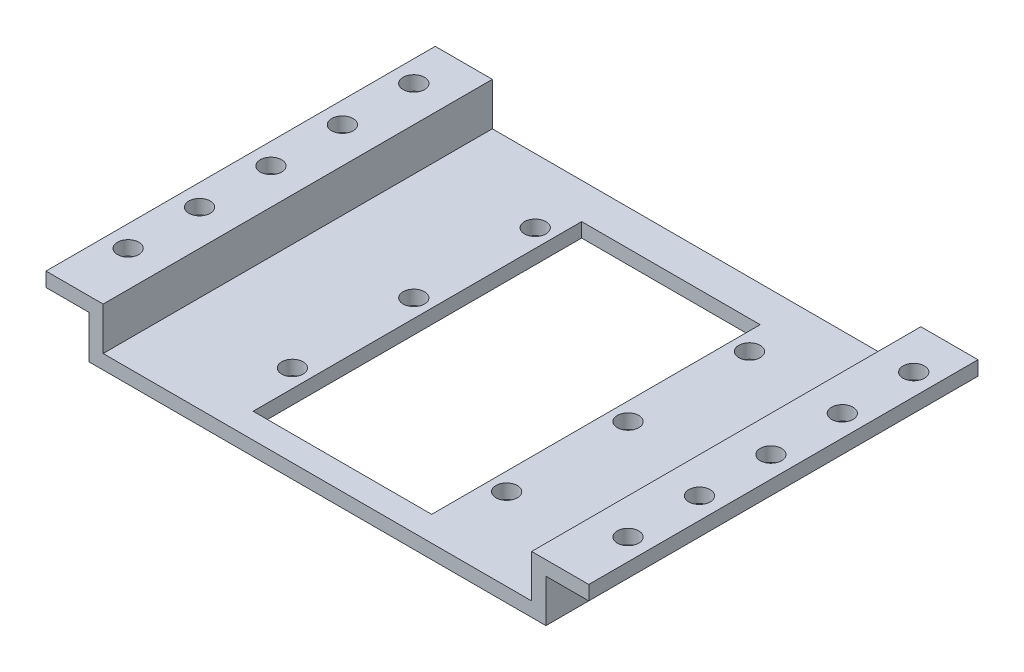
ISO-10303-21;
HEADER;
FILE_DESCRIPTION(('STEP AP214'),'2;1');
FILE_NAME('part.step','',(''),(''),'','','');
FILE_SCHEMA(('AUTOMOTIVE_DESIGN { 1 0 10303 214 1 1 1 1 }'));
ENDSEC;
DATA;
#1=APPLICATION_CONTEXT('core data for automotive mechanical design processes');
#2=APPLICATION_PROTOCOL_DEFINITION('international standard','automotive_design',2000,#1);
#3=PRODUCT_CONTEXT('',#1,'mechanical');
#4=PRODUCT('Part','Part','',(#3));
#5=PRODUCT_RELATED_PRODUCT_CATEGORY('part','',(#4));
#6=PRODUCT_DEFINITION_FORMATION('','',#4);
#7=PRODUCT_DEFINITION_CONTEXT('part definition',#1,'design');
#8=PRODUCT_DEFINITION('design','',#6,#7);
#9=PRODUCT_DEFINITION_SHAPE('','',#8);
#10=(LENGTH_UNIT() NAMED_UNIT(*) SI_UNIT(.MILLI.,.METRE.));
#11=(NAMED_UNIT(*) PLANE_ANGLE_UNIT() SI_UNIT($,.RADIAN.));
#12=(NAMED_UNIT(*) SI_UNIT($,.STERADIAN.) SOLID_ANGLE_UNIT());
#13=UNCERTAINTY_MEASURE_WITH_UNIT(LENGTH_MEASURE(1.E-05),#10,'distance_accuracy_value','');
#14=(GEOMETRIC_REPRESENTATION_CONTEXT(3) GLOBAL_UNCERTAINTY_ASSIGNED_CONTEXT((#13)) GLOBAL_UNIT_ASSIGNED_CONTEXT((#10,
#11,#12)) REPRESENTATION_CONTEXT('',''));
#15=CARTESIAN_POINT('',(0.,0.,0.));
#16=DIRECTION('',(0.,0.,1.));
#17=DIRECTION('',(1.,0.,0.));
#18=AXIS2_PLACEMENT_3D('',#15,#16,#17);
#19=CARTESIAN_POINT('',(-38.,8.,50.));
#20=DIRECTION('',(1.,0.,0.));
#21=DIRECTION('',(0.,0.,-1.));
#22=AXIS2_PLACEMENT_3D('',#19,#20,#21);
#23=PLANE('',#22);
#24=DIRECTION('',(0.,0.,-1.));
#25=VECTOR('',#24,1.);
#26=CARTESIAN_POINT('',(-38.,8.,50.));
#27=LINE('',#26,#25);
#28=CARTESIAN_POINT('',(-38.,8.,58.5));
#29=VERTEX_POINT('',#28);
#30=CARTESIAN_POINT('',(-38.,8.,4.));
#31=VERTEX_POINT('',#30);
#32=EDGE_CURVE('E355',#29,#31,#27,.T.);
#33=ORIENTED_EDGE('',*,*,#32,.T.);
#34=DIRECTION('',(0.,1.,0.));
#35=VECTOR('',#34,1.);
#36=CARTESIAN_POINT('',(-38.,-2.,4.));
#37=LINE('',#36,#35);
#38=CARTESIAN_POINT('',(-38.,6.,4.));
#39=VERTEX_POINT('',#38);
#40=EDGE_CURVE('E220',#39,#31,#37,.T.);
#41=ORIENTED_EDGE('',*,*,#40,.F.);
#42=DIRECTION('',(0.,0.,-1.));
#43=VECTOR('',#42,1.);
#44=CARTESIAN_POINT('',(-38.,6.,50.));
#45=LINE('',#44,#43);
#46=CARTESIAN_POINT('',(-38.,6.,58.5));
#47=VERTEX_POINT('',#46);
#48=EDGE_CURVE('E42',#47,#39,#45,.T.);
#49=ORIENTED_EDGE('',*,*,#48,.F.);
#50=DIRECTION('',(0.,-1.,0.));
#51=VECTOR('',#50,1.);
#52=CARTESIAN_POINT('',(-38.,8.,58.5));
#53=LINE('',#52,#51);
#54=EDGE_CURVE('E211',#29,#47,#53,.T.);
#55=ORIENTED_EDGE('',*,*,#54,.F.);
#56=EDGE_LOOP('',(#33,#41,#49,#55));
#57=FACE_BOUND('',#56,.T.);
#58=ADVANCED_FACE('F34',(#57),#23,.F.);
#59=CARTESIAN_POINT('',(-38.,6.,50.));
#60=DIRECTION('',(0.,1.,0.));
#61=DIRECTION('',(0.,0.,1.));
#62=AXIS2_PLACEMENT_3D('',#59,#60,#61);
#63=PLANE('',#62);
#64=CARTESIAN_POINT('',(-35.,6.,50.));
#65=DIRECTION('',(0.,1.,0.));
#66=DIRECTION('',(0.,0.,1.));
#67=AXIS2_PLACEMENT_3D('',#64,#65,#66);
#68=CIRCLE('',#67,1.49999999999999);
#69=CARTESIAN_POINT('',(-35.,6.,51.5));
#70=VERTEX_POINT('',#69);
#71=EDGE_CURVE('E172',#70,#70,#68,.T.);
#72=ORIENTED_EDGE('',*,*,#71,.T.);
#73=EDGE_LOOP('',(#72));
#74=FACE_BOUND('',#73,.T.);
#75=CARTESIAN_POINT('',(-35.,6.,20.));
#76=DIRECTION('',(0.,1.,0.));
#77=DIRECTION('',(0.,0.,1.));
#78=AXIS2_PLACEMENT_3D('',#75,#76,#77);
#79=CIRCLE('',#78,1.5);
#80=CARTESIAN_POINT('',(-35.,6.,21.5));
#81=VERTEX_POINT('',#80);
#82=EDGE_CURVE('E316',#81,#81,#79,.T.);
#83=ORIENTED_EDGE('',*,*,#82,.T.);
#84=EDGE_LOOP('',(#83));
#85=FACE_BOUND('',#84,.T.);
#86=CARTESIAN_POINT('',(-35.,6.,10.));
#87=DIRECTION('',(0.,1.,0.));
#88=DIRECTION('',(0.,0.,1.));
#89=AXIS2_PLACEMENT_3D('',#86,#87,#88);
#90=CIRCLE('',#89,1.5);
#91=CARTESIAN_POINT('',(-35.,6.,11.5));
#92=VERTEX_POINT('',#91);
#93=EDGE_CURVE('E322',#92,#92,#90,.T.);
#94=ORIENTED_EDGE('',*,*,#93,.T.);
#95=EDGE_LOOP('',(#94));
#96=FACE_BOUND('',#95,.T.);
#97=CARTESIAN_POINT('',(-35.,6.,30.));
#98=DIRECTION('',(0.,1.,0.));
#99=DIRECTION('',(0.,0.,1.));
#100=AXIS2_PLACEMENT_3D('',#97,#98,#99);
#101=CIRCLE('',#100,1.5);
#102=CARTESIAN_POINT('',(-35.,6.,31.5));
#103=VERTEX_POINT('',#102);
#104=EDGE_CURVE('E328',#103,#103,#101,.T.);
#105=ORIENTED_EDGE('',*,*,#104,.T.);
#106=EDGE_LOOP('',(#105));
#107=FACE_BOUND('',#106,.T.);
#108=CARTESIAN_POINT('',(-35.,6.,40.));
#109=DIRECTION('',(0.,1.,0.));
#110=DIRECTION('',(0.,0.,1.));
#111=AXIS2_PLACEMENT_3D('',#108,#109,#110);
#112=CIRCLE('',#111,1.5);
#113=CARTESIAN_POINT('',(-35.,6.,41.5));
#114=VERTEX_POINT('',#113);
#115=EDGE_CURVE('E334',#114,#114,#112,.T.);
#116=ORIENTED_EDGE('',*,*,#115,.T.);
#117=EDGE_LOOP('',(#116));
#118=FACE_BOUND('',#117,.T.);
#119=ORIENTED_EDGE('',*,*,#48,.T.);
#120=DIRECTION('',(1.,0.,0.));
#121=VECTOR('',#120,1.);
#122=CARTESIAN_POINT('',(-38.,6.,4.));
#123=LINE('',#122,#121);
#124=CARTESIAN_POINT('',(-32.,6.,4.));
#125=VERTEX_POINT('',#124);
#126=EDGE_CURVE('E241',#39,#125,#123,.T.);
#127=ORIENTED_EDGE('',*,*,#126,.T.);
#128=DIRECTION('',(0.,0.,-1.));
#129=VECTOR('',#128,1.);
#130=CARTESIAN_POINT('',(-32.,6.,50.));
#131=LINE('',#130,#129);
#132=CARTESIAN_POINT('',(-32.,6.,58.5));
#133=VERTEX_POINT('',#132);
#134=EDGE_CURVE('E367',#133,#125,#131,.T.);
#135=ORIENTED_EDGE('',*,*,#134,.F.);
#136=DIRECTION('',(1.,0.,0.));
#137=VECTOR('',#136,1.);
#138=CARTESIAN_POINT('',(-38.,6.,58.5));
#139=LINE('',#138,#137);
#140=EDGE_CURVE('E214',#47,#133,#139,.T.);
#141=ORIENTED_EDGE('',*,*,#140,.F.);
#142=EDGE_LOOP('',(#119,#127,#135,#141));
#143=FACE_BOUND('',#142,.T.);
#144=ADVANCED_FACE('F395',(#74,#85,#96,#107,#118,#143),#63,.F.);
#145=CARTESIAN_POINT('',(-32.,6.,50.));
#146=DIRECTION('',(1.,0.,0.));
#147=DIRECTION('',(0.,0.,-1.));
#148=AXIS2_PLACEMENT_3D('',#145,#146,#147);
#149=PLANE('',#148);
#150=ORIENTED_EDGE('',*,*,#134,.T.);
#151=DIRECTION('',(0.,-1.,0.));
#152=VECTOR('',#151,1.);
#153=CARTESIAN_POINT('',(-32.,6.,4.));
#154=LINE('',#153,#152);
#155=CARTESIAN_POINT('',(-32.,0.,4.));
#156=VERTEX_POINT('',#155);
#157=EDGE_CURVE('E238',#125,#156,#154,.T.);
#158=ORIENTED_EDGE('',*,*,#157,.T.);
#159=DIRECTION('',(0.,0.,-1.));
#160=VECTOR('',#159,1.);
#161=CARTESIAN_POINT('',(-32.,0.,50.));
#162=LINE('',#161,#160);
#163=CARTESIAN_POINT('',(-32.,0.,58.5));
#164=VERTEX_POINT('',#163);
#165=EDGE_CURVE('E364',#164,#156,#162,.T.);
#166=ORIENTED_EDGE('',*,*,#165,.F.);
#167=DIRECTION('',(0.,-1.,0.));
#168=VECTOR('',#167,1.);
#169=CARTESIAN_POINT('',(-32.,6.,58.5));
#170=LINE('',#169,#168);
#171=EDGE_CURVE('E181',#133,#164,#170,.T.);
#172=ORIENTED_EDGE('',*,*,#171,.F.);
#173=EDGE_LOOP('',(#150,#158,#166,#172));
#174=FACE_BOUND('',#173,.T.);
#175=ADVANCED_FACE('F400',(#174),#149,.F.);
#176=CARTESIAN_POINT('',(-32.,0.,50.));
#177=DIRECTION('',(0.,1.,0.));
#178=DIRECTION('',(0.,0.,1.));
#179=AXIS2_PLACEMENT_3D('',#176,#177,#178);
#180=PLANE('',#179);
#181=DIRECTION('',(1.,0.,0.));
#182=VECTOR('',#181,1.);
#183=CARTESIAN_POINT('',(-32.,0.,55.));
#184=LINE('',#183,#182);
#185=CARTESIAN_POINT('',(-12.5,0.,55.));
#186=VERTEX_POINT('',#185);
#187=CARTESIAN_POINT('',(12.5,0.,55.));
#188=VERTEX_POINT('',#187);
#189=EDGE_CURVE('E165',#186,#188,#184,.T.);
#190=ORIENTED_EDGE('',*,*,#189,.T.);
#191=DIRECTION('',(0.,0.,-1.));
#192=VECTOR('',#191,1.);
#193=CARTESIAN_POINT('',(12.5,0.,50.));
#194=LINE('',#193,#192);
#195=CARTESIAN_POINT('',(12.5,0.,8.99999999999999));
#196=VERTEX_POINT('',#195);
#197=EDGE_CURVE('E284',#188,#196,#194,.T.);
#198=ORIENTED_EDGE('',*,*,#197,.T.);
#199=DIRECTION('',(1.,0.,0.));
#200=VECTOR('',#199,1.);
#201=CARTESIAN_POINT('',(12.5,0.,8.99999999999999));
#202=LINE('',#201,#200);
#203=CARTESIAN_POINT('',(-12.5,0.,8.99999999999999));
#204=VERTEX_POINT('',#203);
#205=EDGE_CURVE('E306',#204,#196,#202,.T.);
#206=ORIENTED_EDGE('',*,*,#205,.F.);
#207=DIRECTION('',(0.,0.,-1.));
#208=VECTOR('',#207,1.);
#209=CARTESIAN_POINT('',(-12.5,0.,50.));
#210=LINE('',#209,#208);
#211=EDGE_CURVE('E155',#186,#204,#210,.T.);
#212=ORIENTED_EDGE('',*,*,#211,.F.);
#213=EDGE_LOOP('',(#190,#198,#206,#212));
#214=FACE_BOUND('',#213,.T.);
#215=CARTESIAN_POINT('',(-15.,0.,47.));
#216=DIRECTION('',(0.,1.,0.));
#217=DIRECTION('',(0.,0.,1.));
#218=AXIS2_PLACEMENT_3D('',#215,#216,#217);
#219=CIRCLE('',#218,1.5);
#220=CARTESIAN_POINT('',(-15.,0.,48.5));
#221=VERTEX_POINT('',#220);
#222=EDGE_CURVE('E340',#221,#221,#219,.T.);
#223=ORIENTED_EDGE('',*,*,#222,.T.);
#224=EDGE_LOOP('',(#223));
#225=FACE_BOUND('',#224,.T.);
#226=CARTESIAN_POINT('',(-15.,0.,30.));
#227=DIRECTION('',(0.,1.,0.));
#228=DIRECTION('',(0.,0.,1.));
#229=AXIS2_PLACEMENT_3D('',#226,#227,#228);
#230=CIRCLE('',#229,1.5);
#231=CARTESIAN_POINT('',(-15.,0.,31.5));
#232=VERTEX_POINT('',#231);
#233=EDGE_CURVE('E346',#232,#232,#230,.T.);
#234=ORIENTED_EDGE('',*,*,#233,.T.);
#235=EDGE_LOOP('',(#234));
#236=FACE_BOUND('',#235,.T.);
#237=CARTESIAN_POINT('',(-15.,0.,13.));
#238=DIRECTION('',(0.,1.,0.));
#239=DIRECTION('',(0.,0.,1.));
#240=AXIS2_PLACEMENT_3D('',#237,#238,#239);
#241=CIRCLE('',#240,1.5);
#242=CARTESIAN_POINT('',(-15.,0.,14.5));
#243=VERTEX_POINT('',#242);
#244=EDGE_CURVE('E352',#243,#243,#241,.T.);
#245=ORIENTED_EDGE('',*,*,#244,.T.);
#246=EDGE_LOOP('',(#245));
#247=FACE_BOUND('',#246,.T.);
#248=ORIENTED_EDGE('',*,*,#165,.T.);
#249=DIRECTION('',(1.,0.,0.));
#250=VECTOR('',#249,1.);
#251=CARTESIAN_POINT('',(-32.,0.,4.));
#252=LINE('',#251,#250);
#253=CARTESIAN_POINT('',(32.,0.,4.));
#254=VERTEX_POINT('',#253);
#255=EDGE_CURVE('E235',#156,#254,#252,.T.);
#256=ORIENTED_EDGE('',*,*,#255,.T.);
#257=DIRECTION('',(0.,0.,-1.));
#258=VECTOR('',#257,1.);
#259=CARTESIAN_POINT('',(32.,0.,50.));
#260=LINE('',#259,#258);
#261=CARTESIAN_POINT('',(32.,0.,58.5));
#262=VERTEX_POINT('',#261);
#263=EDGE_CURVE('E303',#262,#254,#260,.T.);
#264=ORIENTED_EDGE('',*,*,#263,.F.);
#265=DIRECTION('',(1.,0.,0.));
#266=VECTOR('',#265,1.);
#267=CARTESIAN_POINT('',(-32.,0.,58.5));
#268=LINE('',#267,#266);
#269=EDGE_CURVE('E184',#164,#262,#268,.T.);
#270=ORIENTED_EDGE('',*,*,#269,.F.);
#271=EDGE_LOOP('',(#248,#256,#264,#270));
#272=FACE_BOUND('',#271,.T.);
#273=CARTESIAN_POINT('',(15.,0.,13.));
#274=DIRECTION('',(0.,1.,0.));
#275=DIRECTION('',(0.,0.,1.));
#276=AXIS2_PLACEMENT_3D('',#273,#274,#275);
#277=CIRCLE('',#276,1.5);
#278=CARTESIAN_POINT('',(15.,0.,14.5));
#279=VERTEX_POINT('',#278);
#280=EDGE_CURVE('E269',#279,#279,#277,.T.);
#281=ORIENTED_EDGE('',*,*,#280,.T.);
#282=EDGE_LOOP('',(#281));
#283=FACE_BOUND('',#282,.T.);
#284=CARTESIAN_POINT('',(15.,0.,30.));
#285=DIRECTION('',(0.,1.,0.));
#286=DIRECTION('',(0.,0.,1.));
#287=AXIS2_PLACEMENT_3D('',#284,#285,#286);
#288=CIRCLE('',#287,1.5);
#289=CARTESIAN_POINT('',(15.,0.,31.5));
#290=VERTEX_POINT('',#289);
#291=EDGE_CURVE('E275',#290,#290,#288,.T.);
#292=ORIENTED_EDGE('',*,*,#291,.T.);
#293=EDGE_LOOP('',(#292));
#294=FACE_BOUND('',#293,.T.);
#295=CARTESIAN_POINT('',(15.,0.,47.));
#296=DIRECTION('',(0.,1.,0.));
#297=DIRECTION('',(0.,0.,1.));
#298=AXIS2_PLACEMENT_3D('',#295,#296,#297);
#299=CIRCLE('',#298,1.5);
#300=CARTESIAN_POINT('',(15.,0.,48.5));
#301=VERTEX_POINT('',#300);
#302=EDGE_CURVE('E281',#301,#301,#299,.T.);
#303=ORIENTED_EDGE('',*,*,#302,.T.);
#304=EDGE_LOOP('',(#303));
#305=FACE_BOUND('',#304,.T.);
#306=ADVANCED_FACE('F434',(#214,#225,#236,#247,#272,#283,#294,#305),#180,.F.);
#307=CARTESIAN_POINT('',(-12.5,0.,50.));
#308=DIRECTION('',(-1.,0.,0.));
#309=DIRECTION('',(0.,0.,1.));
#310=AXIS2_PLACEMENT_3D('',#307,#308,#309);
#311=PLANE('',#310);
#312=ORIENTED_EDGE('',*,*,#211,.T.);
#313=DIRECTION('',(0.,1.,0.));
#314=VECTOR('',#313,1.);
#315=CARTESIAN_POINT('',(-12.5,0.,8.99999999999999));
#316=LINE('',#315,#314);
#317=CARTESIAN_POINT('',(-12.5,2.,8.99999999999999));
#318=VERTEX_POINT('',#317);
#319=EDGE_CURVE('E152',#204,#318,#316,.T.);
#320=ORIENTED_EDGE('',*,*,#319,.T.);
#321=DIRECTION('',(0.,0.,-1.));
#322=VECTOR('',#321,1.);
#323=CARTESIAN_POINT('',(-12.5,2.,50.));
#324=LINE('',#323,#322);
#325=CARTESIAN_POINT('',(-12.5,2.,55.));
#326=VERTEX_POINT('',#325);
#327=EDGE_CURVE('E147',#326,#318,#324,.T.);
#328=ORIENTED_EDGE('',*,*,#327,.F.);
#329=DIRECTION('',(0.,1.,0.));
#330=VECTOR('',#329,1.);
#331=CARTESIAN_POINT('',(-12.5,-6.5,55.));
#332=LINE('',#331,#330);
#333=EDGE_CURVE('E151',#186,#326,#332,.T.);
#334=ORIENTED_EDGE('',*,*,#333,.F.);
#335=EDGE_LOOP('',(#312,#320,#328,#334));
#336=FACE_BOUND('',#335,.T.);
#337=ADVANCED_FACE('F150',(#336),#311,.F.);
#338=CARTESIAN_POINT('',(-12.5,2.,50.));
#339=DIRECTION('',(0.,-1.,0.));
#340=DIRECTION('',(1.,0.,0.));
#341=AXIS2_PLACEMENT_3D('',#338,#339,#340);
#342=PLANE('',#341);
#343=DIRECTION('',(0.,0.,-1.));
#344=VECTOR('',#343,1.);
#345=CARTESIAN_POINT('',(-30.,2.,50.));
#346=LINE('',#345,#344);
#347=CARTESIAN_POINT('',(-30.,2.,58.5));
#348=VERTEX_POINT('',#347);
#349=CARTESIAN_POINT('',(-30.,2.,4.00000000000001));
#350=VERTEX_POINT('',#349);
#351=EDGE_CURVE('E156',#348,#350,#346,.T.);
#352=ORIENTED_EDGE('',*,*,#351,.F.);
#353=DIRECTION('',(-1.,0.,0.));
#354=VECTOR('',#353,1.);
#355=CARTESIAN_POINT('',(-30.,2.,58.5));
#356=LINE('',#355,#354);
#357=CARTESIAN_POINT('',(30.,2.,58.5));
#358=VERTEX_POINT('',#357);
#359=EDGE_CURVE('E202',#358,#348,#356,.T.);
#360=ORIENTED_EDGE('',*,*,#359,.F.);
#361=DIRECTION('',(0.,0.,-1.));
#362=VECTOR('',#361,1.);
#363=CARTESIAN_POINT('',(30.,2.,50.));
#364=LINE('',#363,#362);
#365=CARTESIAN_POINT('',(30.,2.,4.));
#366=VERTEX_POINT('',#365);
#367=EDGE_CURVE('E288',#358,#366,#364,.T.);
#368=ORIENTED_EDGE('',*,*,#367,.T.);
#369=DIRECTION('',(-1.,0.,0.));
#370=VECTOR('',#369,1.);
#371=CARTESIAN_POINT('',(-12.5,2.,4.));
#372=LINE('',#371,#370);
#373=EDGE_CURVE('E49',#366,#350,#372,.T.);
#374=ORIENTED_EDGE('',*,*,#373,.T.);
#375=EDGE_LOOP('',(#352,#360,#368,#374));
#376=FACE_BOUND('',#375,.T.);
#377=CARTESIAN_POINT('',(-15.,2.,47.));
#378=DIRECTION('',(0.,1.,0.));
#379=DIRECTION('',(0.,0.,1.));
#380=AXIS2_PLACEMENT_3D('',#377,#378,#379);
#381=CIRCLE('',#380,1.5);
#382=CARTESIAN_POINT('',(-15.,2.,48.5));
#383=VERTEX_POINT('',#382);
#384=EDGE_CURVE('E337',#383,#383,#381,.T.);
#385=ORIENTED_EDGE('',*,*,#384,.F.);
#386=EDGE_LOOP('',(#385));
#387=FACE_BOUND('',#386,.T.);
#388=CARTESIAN_POINT('',(-15.,2.,30.));
#389=DIRECTION('',(0.,1.,0.));
#390=DIRECTION('',(0.,0.,1.));
#391=AXIS2_PLACEMENT_3D('',#388,#389,#390);
#392=CIRCLE('',#391,1.5);
#393=CARTESIAN_POINT('',(-15.,2.,31.5));
#394=VERTEX_POINT('',#393);
#395=EDGE_CURVE('E343',#394,#394,#392,.T.);
#396=ORIENTED_EDGE('',*,*,#395,.F.);
#397=EDGE_LOOP('',(#396));
#398=FACE_BOUND('',#397,.T.);
#399=CARTESIAN_POINT('',(-15.,2.,13.));
#400=DIRECTION('',(0.,1.,0.));
#401=DIRECTION('',(0.,0.,1.));
#402=AXIS2_PLACEMENT_3D('',#399,#400,#401);
#403=CIRCLE('',#402,1.5);
#404=CARTESIAN_POINT('',(-15.,2.,14.5));
#405=VERTEX_POINT('',#404);
#406=EDGE_CURVE('E349',#405,#405,#403,.T.);
#407=ORIENTED_EDGE('',*,*,#406,.F.);
#408=EDGE_LOOP('',(#407));
#409=FACE_BOUND('',#408,.T.);
#410=DIRECTION('',(0.,0.,-1.));
#411=VECTOR('',#410,1.);
#412=CARTESIAN_POINT('',(12.5,2.,50.));
#413=LINE('',#412,#411);
#414=CARTESIAN_POINT('',(12.5,2.,55.));
#415=VERTEX_POINT('',#414);
#416=CARTESIAN_POINT('',(12.5,2.,8.99999999999999));
#417=VERTEX_POINT('',#416);
#418=EDGE_CURVE('E170',#415,#417,#413,.T.);
#419=ORIENTED_EDGE('',*,*,#418,.F.);
#420=DIRECTION('',(1.,0.,0.));
#421=VECTOR('',#420,1.);
#422=CARTESIAN_POINT('',(12.5,2.,55.));
#423=LINE('',#422,#421);
#424=EDGE_CURVE('E163',#326,#415,#423,.T.);
#425=ORIENTED_EDGE('',*,*,#424,.F.);
#426=ORIENTED_EDGE('',*,*,#327,.T.);
#427=DIRECTION('',(1.,0.,0.));
#428=VECTOR('',#427,1.);
#429=CARTESIAN_POINT('',(12.5,2.,8.99999999999999));
#430=LINE('',#429,#428);
#431=EDGE_CURVE('E56',#318,#417,#430,.T.);
#432=ORIENTED_EDGE('',*,*,#431,.T.);
#433=EDGE_LOOP('',(#419,#425,#426,#432));
#434=FACE_BOUND('',#433,.T.);
#435=CARTESIAN_POINT('',(15.,2.,13.));
#436=DIRECTION('',(0.,1.,0.));
#437=DIRECTION('',(0.,0.,1.));
#438=AXIS2_PLACEMENT_3D('',#435,#436,#437);
#439=CIRCLE('',#438,1.5);
#440=CARTESIAN_POINT('',(15.,2.,14.5));
#441=VERTEX_POINT('',#440);
#442=EDGE_CURVE('E266',#441,#441,#439,.T.);
#443=ORIENTED_EDGE('',*,*,#442,.F.);
#444=EDGE_LOOP('',(#443));
#445=FACE_BOUND('',#444,.T.);
#446=CARTESIAN_POINT('',(15.,2.,30.));
#447=DIRECTION('',(0.,1.,0.));
#448=DIRECTION('',(0.,0.,1.));
#449=AXIS2_PLACEMENT_3D('',#446,#447,#448);
#450=CIRCLE('',#449,1.5);
#451=CARTESIAN_POINT('',(15.,2.,31.5));
#452=VERTEX_POINT('',#451);
#453=EDGE_CURVE('E272',#452,#452,#450,.T.);
#454=ORIENTED_EDGE('',*,*,#453,.F.);
#455=EDGE_LOOP('',(#454));
#456=FACE_BOUND('',#455,.T.);
#457=CARTESIAN_POINT('',(15.,2.,47.));
#458=DIRECTION('',(0.,1.,0.));
#459=DIRECTION('',(0.,0.,1.));
#460=AXIS2_PLACEMENT_3D('',#457,#458,#459);
#461=CIRCLE('',#460,1.5);
#462=CARTESIAN_POINT('',(15.,2.,48.5));
#463=VERTEX_POINT('',#462);
#464=EDGE_CURVE('E278',#463,#463,#461,.T.);
#465=ORIENTED_EDGE('',*,*,#464,.F.);
#466=EDGE_LOOP('',(#465));
#467=FACE_BOUND('',#466,.T.);
#468=ADVANCED_FACE('F168',(#376,#387,#398,#409,#434,#445,#456,#467),#342,.F.);
#469=CARTESIAN_POINT('',(-30.,2.,50.));
#470=DIRECTION('',(-1.,0.,0.));
#471=DIRECTION('',(0.,0.,1.));
#472=AXIS2_PLACEMENT_3D('',#469,#470,#471);
#473=PLANE('',#472);
#474=ORIENTED_EDGE('',*,*,#351,.T.);
#475=DIRECTION('',(0.,1.,0.));
#476=VECTOR('',#475,1.);
#477=CARTESIAN_POINT('',(-30.,2.,4.));
#478=LINE('',#477,#476);
#479=CARTESIAN_POINT('',(-30.,8.,4.));
#480=VERTEX_POINT('',#479);
#481=EDGE_CURVE('E226',#350,#480,#478,.T.);
#482=ORIENTED_EDGE('',*,*,#481,.T.);
#483=DIRECTION('',(0.,0.,-1.));
#484=VECTOR('',#483,1.);
#485=CARTESIAN_POINT('',(-30.,8.,50.));
#486=LINE('',#485,#484);
#487=CARTESIAN_POINT('',(-30.,8.,58.5));
#488=VERTEX_POINT('',#487);
#489=EDGE_CURVE('E358',#488,#480,#486,.T.);
#490=ORIENTED_EDGE('',*,*,#489,.F.);
#491=DIRECTION('',(0.,1.,0.));
#492=VECTOR('',#491,1.);
#493=CARTESIAN_POINT('',(-30.,2.,58.5));
#494=LINE('',#493,#492);
#495=EDGE_CURVE('E205',#348,#488,#494,.T.);
#496=ORIENTED_EDGE('',*,*,#495,.F.);
#497=EDGE_LOOP('',(#474,#482,#490,#496));
#498=FACE_BOUND('',#497,.T.);
#499=ADVANCED_FACE('F414',(#498),#473,.F.);
#500=CARTESIAN_POINT('',(-30.,8.,50.));
#501=DIRECTION('',(0.,-1.,0.));
#502=DIRECTION('',(0.,0.,-1.));
#503=AXIS2_PLACEMENT_3D('',#500,#501,#502);
#504=PLANE('',#503);
#505=CARTESIAN_POINT('',(-35.,8.,50.));
#506=DIRECTION('',(0.,1.,0.));
#507=DIRECTION('',(0.,0.,1.));
#508=AXIS2_PLACEMENT_3D('',#505,#506,#507);
#509=CIRCLE('',#508,1.49999999999999);
#510=CARTESIAN_POINT('',(-35.,8.,51.5));
#511=VERTEX_POINT('',#510);
#512=EDGE_CURVE('E175',#511,#511,#509,.T.);
#513=ORIENTED_EDGE('',*,*,#512,.F.);
#514=EDGE_LOOP('',(#513));
#515=FACE_BOUND('',#514,.T.);
#516=CARTESIAN_POINT('',(-35.,7.99999999999999,20.));
#517=DIRECTION('',(0.,1.,0.));
#518=DIRECTION('',(0.,0.,1.));
#519=AXIS2_PLACEMENT_3D('',#516,#517,#518);
#520=CIRCLE('',#519,1.5);
#521=CARTESIAN_POINT('',(-35.,7.99999999999999,21.5));
#522=VERTEX_POINT('',#521);
#523=EDGE_CURVE('E312',#522,#522,#520,.T.);
#524=ORIENTED_EDGE('',*,*,#523,.F.);
#525=EDGE_LOOP('',(#524));
#526=FACE_BOUND('',#525,.T.);
#527=CARTESIAN_POINT('',(-35.,7.99999999999999,10.));
#528=DIRECTION('',(0.,1.,0.));
#529=DIRECTION('',(0.,0.,1.));
#530=AXIS2_PLACEMENT_3D('',#527,#528,#529);
#531=CIRCLE('',#530,1.5);
#532=CARTESIAN_POINT('',(-35.,7.99999999999999,11.5));
#533=VERTEX_POINT('',#532);
#534=EDGE_CURVE('E319',#533,#533,#531,.T.);
#535=ORIENTED_EDGE('',*,*,#534,.F.);
#536=EDGE_LOOP('',(#535));
#537=FACE_BOUND('',#536,.T.);
#538=CARTESIAN_POINT('',(-35.,7.99999999999999,30.));
#539=DIRECTION('',(0.,1.,0.));
#540=DIRECTION('',(0.,0.,1.));
#541=AXIS2_PLACEMENT_3D('',#538,#539,#540);
#542=CIRCLE('',#541,1.5);
#543=CARTESIAN_POINT('',(-35.,7.99999999999999,31.5));
#544=VERTEX_POINT('',#543);
#545=EDGE_CURVE('E325',#544,#544,#542,.T.);
#546=ORIENTED_EDGE('',*,*,#545,.F.);
#547=EDGE_LOOP('',(#546));
#548=FACE_BOUND('',#547,.T.);
#549=CARTESIAN_POINT('',(-35.,7.99999999999999,40.));
#550=DIRECTION('',(0.,1.,0.));
#551=DIRECTION('',(0.,0.,1.));
#552=AXIS2_PLACEMENT_3D('',#549,#550,#551);
#553=CIRCLE('',#552,1.5);
#554=CARTESIAN_POINT('',(-35.,7.99999999999999,41.5));
#555=VERTEX_POINT('',#554);
#556=EDGE_CURVE('E331',#555,#555,#553,.T.);
#557=ORIENTED_EDGE('',*,*,#556,.F.);
#558=EDGE_LOOP('',(#557));
#559=FACE_BOUND('',#558,.T.);
#560=ORIENTED_EDGE('',*,*,#489,.T.);
#561=DIRECTION('',(1.,0.,0.));
#562=VECTOR('',#561,1.);
#563=CARTESIAN_POINT('',(38.,8.,3.99999999999999));
#564=LINE('',#563,#562);
#565=EDGE_CURVE('E218',#31,#480,#564,.T.);
#566=ORIENTED_EDGE('',*,*,#565,.F.);
#567=ORIENTED_EDGE('',*,*,#32,.F.);
#568=DIRECTION('',(-1.,0.,0.));
#569=VECTOR('',#568,1.);
#570=CARTESIAN_POINT('',(-30.,8.,58.5));
#571=LINE('',#570,#569);
#572=EDGE_CURVE('E208',#488,#29,#571,.T.);
#573=ORIENTED_EDGE('',*,*,#572,.F.);
#574=EDGE_LOOP('',(#560,#566,#567,#573));
#575=FACE_BOUND('',#574,.T.);
#576=ADVANCED_FACE('F407',(#515,#526,#537,#548,#559,#575),#504,.F.);
#577=CARTESIAN_POINT('',(-15.,2.,13.));
#578=DIRECTION('',(0.,1.,0.));
#579=DIRECTION('',(0.,0.,1.));
#580=AXIS2_PLACEMENT_3D('',#577,#578,#579);
#581=CYLINDRICAL_SURFACE('',#580,1.5);
#582=ORIENTED_EDGE('',*,*,#244,.F.);
#583=EDGE_LOOP('',(#582));
#584=FACE_BOUND('',#583,.T.);
#585=ORIENTED_EDGE('',*,*,#406,.T.);
#586=EDGE_LOOP('',(#585));
#587=FACE_BOUND('',#586,.T.);
#588=ADVANCED_FACE('F455',(#584,#587),#581,.F.);
#589=CARTESIAN_POINT('',(-15.,2.,30.));
#590=DIRECTION('',(0.,1.,0.));
#591=DIRECTION('',(0.,0.,1.));
#592=AXIS2_PLACEMENT_3D('',#589,#590,#591);
#593=CYLINDRICAL_SURFACE('',#592,1.5);
#594=ORIENTED_EDGE('',*,*,#233,.F.);
#595=EDGE_LOOP('',(#594));
#596=FACE_BOUND('',#595,.T.);
#597=ORIENTED_EDGE('',*,*,#395,.T.);
#598=EDGE_LOOP('',(#597));
#599=FACE_BOUND('',#598,.T.);
#600=ADVANCED_FACE('F459',(#596,#599),#593,.F.);
#601=CARTESIAN_POINT('',(-15.,2.,47.));
#602=DIRECTION('',(0.,1.,0.));
#603=DIRECTION('',(0.,0.,1.));
#604=AXIS2_PLACEMENT_3D('',#601,#602,#603);
#605=CYLINDRICAL_SURFACE('',#604,1.5);
#606=ORIENTED_EDGE('',*,*,#222,.F.);
#607=EDGE_LOOP('',(#606));
#608=FACE_BOUND('',#607,.T.);
#609=ORIENTED_EDGE('',*,*,#384,.T.);
#610=EDGE_LOOP('',(#609));
#611=FACE_BOUND('',#610,.T.);
#612=ADVANCED_FACE('F463',(#608,#611),#605,.F.);
#613=CARTESIAN_POINT('',(-35.,7.99999999999999,40.));
#614=DIRECTION('',(0.,1.,0.));
#615=DIRECTION('',(0.,0.,1.));
#616=AXIS2_PLACEMENT_3D('',#613,#614,#615);
#617=CYLINDRICAL_SURFACE('',#616,1.5);
#618=ORIENTED_EDGE('',*,*,#556,.T.);
#619=EDGE_LOOP('',(#618));
#620=FACE_BOUND('',#619,.T.);
#621=ORIENTED_EDGE('',*,*,#115,.F.);
#622=EDGE_LOOP('',(#621));
#623=FACE_BOUND('',#622,.T.);
#624=ADVANCED_FACE('F467',(#620,#623),#617,.F.);
#625=CARTESIAN_POINT('',(-35.,7.99999999999999,30.));
#626=DIRECTION('',(0.,1.,0.));
#627=DIRECTION('',(0.,0.,1.));
#628=AXIS2_PLACEMENT_3D('',#625,#626,#627);
#629=CYLINDRICAL_SURFACE('',#628,1.5);
#630=ORIENTED_EDGE('',*,*,#545,.T.);
#631=EDGE_LOOP('',(#630));
#632=FACE_BOUND('',#631,.T.);
#633=ORIENTED_EDGE('',*,*,#104,.F.);
#634=EDGE_LOOP('',(#633));
#635=FACE_BOUND('',#634,.T.);
#636=ADVANCED_FACE('F471',(#632,#635),#629,.F.);
#637=CARTESIAN_POINT('',(-35.,7.99999999999999,10.));
#638=DIRECTION('',(0.,1.,0.));
#639=DIRECTION('',(0.,0.,1.));
#640=AXIS2_PLACEMENT_3D('',#637,#638,#639);
#641=CYLINDRICAL_SURFACE('',#640,1.5);
#642=ORIENTED_EDGE('',*,*,#534,.T.);
#643=EDGE_LOOP('',(#642));
#644=FACE_BOUND('',#643,.T.);
#645=ORIENTED_EDGE('',*,*,#93,.F.);
#646=EDGE_LOOP('',(#645));
#647=FACE_BOUND('',#646,.T.);
#648=ADVANCED_FACE('F475',(#644,#647),#641,.F.);
#649=CARTESIAN_POINT('',(-35.,7.99999999999999,20.));
#650=DIRECTION('',(0.,1.,0.));
#651=DIRECTION('',(0.,0.,1.));
#652=AXIS2_PLACEMENT_3D('',#649,#650,#651);
#653=CYLINDRICAL_SURFACE('',#652,1.5);
#654=ORIENTED_EDGE('',*,*,#523,.T.);
#655=EDGE_LOOP('',(#654));
#656=FACE_BOUND('',#655,.T.);
#657=ORIENTED_EDGE('',*,*,#82,.F.);
#658=EDGE_LOOP('',(#657));
#659=FACE_BOUND('',#658,.T.);
#660=ADVANCED_FACE('F479',(#656,#659),#653,.F.);
#661=CARTESIAN_POINT('',(12.5,0.,8.99999999999999));
#662=DIRECTION('',(0.,0.,1.));
#663=DIRECTION('',(1.,0.,0.));
#664=AXIS2_PLACEMENT_3D('',#661,#662,#663);
#665=PLANE('',#664);
#666=ORIENTED_EDGE('',*,*,#431,.F.);
#667=ORIENTED_EDGE('',*,*,#319,.F.);
#668=ORIENTED_EDGE('',*,*,#205,.T.);
#669=DIRECTION('',(0.,1.,0.));
#670=VECTOR('',#669,1.);
#671=CARTESIAN_POINT('',(12.5,0.,8.99999999999999));
#672=LINE('',#671,#670);
#673=EDGE_CURVE('E310',#196,#417,#672,.T.);
#674=ORIENTED_EDGE('',*,*,#673,.T.);
#675=EDGE_LOOP('',(#666,#667,#668,#674));
#676=FACE_BOUND('',#675,.T.);
#677=ADVANCED_FACE('F483',(#676),#665,.T.);
#678=CARTESIAN_POINT('',(32.,6.,50.));
#679=DIRECTION('',(-1.,0.,0.));
#680=DIRECTION('',(0.,0.,1.));
#681=AXIS2_PLACEMENT_3D('',#678,#679,#680);
#682=PLANE('',#681);
#683=ORIENTED_EDGE('',*,*,#263,.T.);
#684=DIRECTION('',(0.,1.,0.));
#685=VECTOR('',#684,1.);
#686=CARTESIAN_POINT('',(32.,6.,4.));
#687=LINE('',#686,#685);
#688=CARTESIAN_POINT('',(32.,6.,4.));
#689=VERTEX_POINT('',#688);
#690=EDGE_CURVE('E232',#254,#689,#687,.T.);
#691=ORIENTED_EDGE('',*,*,#690,.T.);
#692=DIRECTION('',(0.,0.,-1.));
#693=VECTOR('',#692,1.);
#694=CARTESIAN_POINT('',(32.,6.,50.));
#695=LINE('',#694,#693);
#696=CARTESIAN_POINT('',(32.,6.,58.5));
#697=VERTEX_POINT('',#696);
#698=EDGE_CURVE('E300',#697,#689,#695,.T.);
#699=ORIENTED_EDGE('',*,*,#698,.F.);
#700=DIRECTION('',(0.,1.,0.));
#701=VECTOR('',#700,1.);
#702=CARTESIAN_POINT('',(32.,0.,58.5));
#703=LINE('',#702,#701);
#704=EDGE_CURVE('E187',#262,#697,#703,.T.);
#705=ORIENTED_EDGE('',*,*,#704,.F.);
#706=EDGE_LOOP('',(#683,#691,#699,#705));
#707=FACE_BOUND('',#706,.T.);
#708=ADVANCED_FACE('F432',(#707),#682,.F.);
#709=CARTESIAN_POINT('',(38.,6.,50.));
#710=DIRECTION('',(0.,1.,0.));
#711=DIRECTION('',(0.,0.,1.));
#712=AXIS2_PLACEMENT_3D('',#709,#710,#711);
#713=PLANE('',#712);
#714=CARTESIAN_POINT('',(35.,6.,50.));
#715=DIRECTION('',(0.,1.,0.));
#716=DIRECTION('',(0.,0.,1.));
#717=AXIS2_PLACEMENT_3D('',#714,#715,#716);
#718=CIRCLE('',#717,1.49999999999999);
#719=CARTESIAN_POINT('',(35.,6.,51.5));
#720=VERTEX_POINT('',#719);
#721=EDGE_CURVE('E37',#720,#720,#718,.T.);
#722=ORIENTED_EDGE('',*,*,#721,.T.);
#723=EDGE_LOOP('',(#722));
#724=FACE_BOUND('',#723,.T.);
#725=CARTESIAN_POINT('',(35.,6.,20.));
#726=DIRECTION('',(0.,1.,0.));
#727=DIRECTION('',(0.,0.,1.));
#728=AXIS2_PLACEMENT_3D('',#725,#726,#727);
#729=CIRCLE('',#728,1.5);
#730=CARTESIAN_POINT('',(35.,6.,21.5));
#731=VERTEX_POINT('',#730);
#732=EDGE_CURVE('E247',#731,#731,#729,.T.);
#733=ORIENTED_EDGE('',*,*,#732,.T.);
#734=EDGE_LOOP('',(#733));
#735=FACE_BOUND('',#734,.T.);
#736=CARTESIAN_POINT('',(35.,6.,10.));
#737=DIRECTION('',(0.,1.,0.));
#738=DIRECTION('',(0.,0.,1.));
#739=AXIS2_PLACEMENT_3D('',#736,#737,#738);
#740=CIRCLE('',#739,1.5);
#741=CARTESIAN_POINT('',(35.,6.,11.5));
#742=VERTEX_POINT('',#741);
#743=EDGE_CURVE('E253',#742,#742,#740,.T.);
#744=ORIENTED_EDGE('',*,*,#743,.T.);
#745=EDGE_LOOP('',(#744));
#746=FACE_BOUND('',#745,.T.);
#747=CARTESIAN_POINT('',(35.,6.,30.));
#748=DIRECTION('',(0.,1.,0.));
#749=DIRECTION('',(0.,0.,1.));
#750=AXIS2_PLACEMENT_3D('',#747,#748,#749);
#751=CIRCLE('',#750,1.5);
#752=CARTESIAN_POINT('',(35.,6.,31.5));
#753=VERTEX_POINT('',#752);
#754=EDGE_CURVE('E259',#753,#753,#751,.T.);
#755=ORIENTED_EDGE('',*,*,#754,.T.);
#756=EDGE_LOOP('',(#755));
#757=FACE_BOUND('',#756,.T.);
#758=CARTESIAN_POINT('',(35.,6.,40.));
#759=DIRECTION('',(0.,1.,0.));
#760=DIRECTION('',(0.,0.,1.));
#761=AXIS2_PLACEMENT_3D('',#758,#759,#760);
#762=CIRCLE('',#761,1.5);
#763=CARTESIAN_POINT('',(35.,6.,41.5));
#764=VERTEX_POINT('',#763);
#765=EDGE_CURVE('E265',#764,#764,#762,.T.);
#766=ORIENTED_EDGE('',*,*,#765,.T.);
#767=EDGE_LOOP('',(#766));
#768=FACE_BOUND('',#767,.T.);
#769=ORIENTED_EDGE('',*,*,#698,.T.);
#770=DIRECTION('',(1.,0.,0.));
#771=VECTOR('',#770,1.);
#772=CARTESIAN_POINT('',(38.,6.,4.));
#773=LINE('',#772,#771);
#774=CARTESIAN_POINT('',(38.,6.,3.99999999999999));
#775=VERTEX_POINT('',#774);
#776=EDGE_CURVE('E229',#689,#775,#773,.T.);
#777=ORIENTED_EDGE('',*,*,#776,.T.);
#778=DIRECTION('',(0.,0.,-1.));
#779=VECTOR('',#778,1.);
#780=CARTESIAN_POINT('',(38.,6.,50.));
#781=LINE('',#780,#779);
#782=CARTESIAN_POINT('',(38.,6.,58.5));
#783=VERTEX_POINT('',#782);
#784=EDGE_CURVE('E297',#783,#775,#781,.T.);
#785=ORIENTED_EDGE('',*,*,#784,.F.);
#786=DIRECTION('',(1.,0.,0.));
#787=VECTOR('',#786,1.);
#788=CARTESIAN_POINT('',(32.,6.,58.5));
#789=LINE('',#788,#787);
#790=EDGE_CURVE('E190',#697,#783,#789,.T.);
#791=ORIENTED_EDGE('',*,*,#790,.F.);
#792=EDGE_LOOP('',(#769,#777,#785,#791));
#793=FACE_BOUND('',#792,.T.);
#794=ADVANCED_FACE('F375',(#724,#735,#746,#757,#768,#793),#713,.F.);
#795=CARTESIAN_POINT('',(38.,8.,50.));
#796=DIRECTION('',(-1.,0.,0.));
#797=DIRECTION('',(0.,0.,1.));
#798=AXIS2_PLACEMENT_3D('',#795,#796,#797);
#799=PLANE('',#798);
#800=ORIENTED_EDGE('',*,*,#784,.T.);
#801=DIRECTION('',(0.,1.,0.));
#802=VECTOR('',#801,1.);
#803=CARTESIAN_POINT('',(38.,-2.,3.99999999999999));
#804=LINE('',#803,#802);
#805=CARTESIAN_POINT('',(38.,8.,3.99999999999999));
#806=VERTEX_POINT('',#805);
#807=EDGE_CURVE('E221',#775,#806,#804,.T.);
#808=ORIENTED_EDGE('',*,*,#807,.T.);
#809=DIRECTION('',(0.,0.,-1.));
#810=VECTOR('',#809,1.);
#811=CARTESIAN_POINT('',(38.,8.,50.));
#812=LINE('',#811,#810);
#813=CARTESIAN_POINT('',(38.,8.,58.5));
#814=VERTEX_POINT('',#813);
#815=EDGE_CURVE('E294',#814,#806,#812,.T.);
#816=ORIENTED_EDGE('',*,*,#815,.F.);
#817=DIRECTION('',(0.,1.,0.));
#818=VECTOR('',#817,1.);
#819=CARTESIAN_POINT('',(38.,6.,58.5));
#820=LINE('',#819,#818);
#821=EDGE_CURVE('E193',#783,#814,#820,.T.);
#822=ORIENTED_EDGE('',*,*,#821,.F.);
#823=EDGE_LOOP('',(#800,#808,#816,#822));
#824=FACE_BOUND('',#823,.T.);
#825=ADVANCED_FACE('F427',(#824),#799,.F.);
#826=CARTESIAN_POINT('',(30.,8.,50.));
#827=DIRECTION('',(0.,-1.,0.));
#828=DIRECTION('',(0.,0.,-1.));
#829=AXIS2_PLACEMENT_3D('',#826,#827,#828);
#830=PLANE('',#829);
#831=CARTESIAN_POINT('',(35.,8.,50.));
#832=DIRECTION('',(0.,1.,0.));
#833=DIRECTION('',(0.,0.,1.));
#834=AXIS2_PLACEMENT_3D('',#831,#832,#833);
#835=CIRCLE('',#834,1.49999999999999);
#836=CARTESIAN_POINT('',(35.,8.,51.5));
#837=VERTEX_POINT('',#836);
#838=EDGE_CURVE('E703',#837,#837,#835,.T.);
#839=ORIENTED_EDGE('',*,*,#838,.F.);
#840=EDGE_LOOP('',(#839));
#841=FACE_BOUND('',#840,.T.);
#842=CARTESIAN_POINT('',(35.,7.99999999999999,20.));
#843=DIRECTION('',(0.,1.,0.));
#844=DIRECTION('',(0.,0.,1.));
#845=AXIS2_PLACEMENT_3D('',#842,#843,#844);
#846=CIRCLE('',#845,1.5);
#847=CARTESIAN_POINT('',(35.,7.99999999999999,21.5));
#848=VERTEX_POINT('',#847);
#849=EDGE_CURVE('E244',#848,#848,#846,.T.);
#850=ORIENTED_EDGE('',*,*,#849,.F.);
#851=EDGE_LOOP('',(#850));
#852=FACE_BOUND('',#851,.T.);
#853=CARTESIAN_POINT('',(35.,7.99999999999999,10.));
#854=DIRECTION('',(0.,1.,0.));
#855=DIRECTION('',(0.,0.,1.));
#856=AXIS2_PLACEMENT_3D('',#853,#854,#855);
#857=CIRCLE('',#856,1.5);
#858=CARTESIAN_POINT('',(35.,7.99999999999999,11.5));
#859=VERTEX_POINT('',#858);
#860=EDGE_CURVE('E250',#859,#859,#857,.T.);
#861=ORIENTED_EDGE('',*,*,#860,.F.);
#862=EDGE_LOOP('',(#861));
#863=FACE_BOUND('',#862,.T.);
#864=CARTESIAN_POINT('',(35.,7.99999999999999,30.));
#865=DIRECTION('',(0.,1.,0.));
#866=DIRECTION('',(0.,0.,1.));
#867=AXIS2_PLACEMENT_3D('',#864,#865,#866);
#868=CIRCLE('',#867,1.5);
#869=CARTESIAN_POINT('',(35.,7.99999999999999,31.5));
#870=VERTEX_POINT('',#869);
#871=EDGE_CURVE('E256',#870,#870,#868,.T.);
#872=ORIENTED_EDGE('',*,*,#871,.F.);
#873=EDGE_LOOP('',(#872));
#874=FACE_BOUND('',#873,.T.);
#875=CARTESIAN_POINT('',(35.,7.99999999999999,40.));
#876=DIRECTION('',(0.,1.,0.));
#877=DIRECTION('',(0.,0.,1.));
#878=AXIS2_PLACEMENT_3D('',#875,#876,#877);
#879=CIRCLE('',#878,1.5);
#880=CARTESIAN_POINT('',(35.,7.99999999999999,41.5));
#881=VERTEX_POINT('',#880);
#882=EDGE_CURVE('E262',#881,#881,#879,.T.);
#883=ORIENTED_EDGE('',*,*,#882,.F.);
#884=EDGE_LOOP('',(#883));
#885=FACE_BOUND('',#884,.T.);
#886=ORIENTED_EDGE('',*,*,#815,.T.);
#887=CARTESIAN_POINT('',(30.,8.,3.99999999999999));
#888=VERTEX_POINT('',#887);
#889=EDGE_CURVE('E217',#888,#806,#564,.T.);
#890=ORIENTED_EDGE('',*,*,#889,.F.);
#891=DIRECTION('',(0.,0.,-1.));
#892=VECTOR('',#891,1.);
#893=CARTESIAN_POINT('',(30.,8.,50.));
#894=LINE('',#893,#892);
#895=CARTESIAN_POINT('',(30.,8.,58.5));
#896=VERTEX_POINT('',#895);
#897=EDGE_CURVE('E291',#896,#888,#894,.T.);
#898=ORIENTED_EDGE('',*,*,#897,.F.);
#899=DIRECTION('',(-1.,0.,0.));
#900=VECTOR('',#899,1.);
#901=CARTESIAN_POINT('',(38.,8.,58.5));
#902=LINE('',#901,#900);
#903=EDGE_CURVE('E196',#814,#896,#902,.T.);
#904=ORIENTED_EDGE('',*,*,#903,.F.);
#905=EDGE_LOOP('',(#886,#890,#898,#904));
#906=FACE_BOUND('',#905,.T.);
#907=ADVANCED_FACE('F424',(#841,#852,#863,#874,#885,#906),#830,.F.);
#908=CARTESIAN_POINT('',(30.,2.,50.));
#909=DIRECTION('',(1.,0.,0.));
#910=DIRECTION('',(0.,0.,-1.));
#911=AXIS2_PLACEMENT_3D('',#908,#909,#910);
#912=PLANE('',#911);
#913=ORIENTED_EDGE('',*,*,#897,.T.);
#914=DIRECTION('',(0.,-1.,0.));
#915=VECTOR('',#914,1.);
#916=CARTESIAN_POINT('',(30.,2.,4.));
#917=LINE('',#916,#915);
#918=EDGE_CURVE('E11',#888,#366,#917,.T.);
#919=ORIENTED_EDGE('',*,*,#918,.T.);
#920=ORIENTED_EDGE('',*,*,#367,.F.);
#921=DIRECTION('',(0.,-1.,0.));
#922=VECTOR('',#921,1.);
#923=CARTESIAN_POINT('',(30.,8.,58.5));
#924=LINE('',#923,#922);
#925=EDGE_CURVE('E199',#896,#358,#924,.T.);
#926=ORIENTED_EDGE('',*,*,#925,.F.);
#927=EDGE_LOOP('',(#913,#919,#920,#926));
#928=FACE_BOUND('',#927,.T.);
#929=ADVANCED_FACE('F420',(#928),#912,.F.);
#930=CARTESIAN_POINT('',(12.5,0.,50.));
#931=DIRECTION('',(1.,0.,0.));
#932=DIRECTION('',(0.,0.,-1.));
#933=AXIS2_PLACEMENT_3D('',#930,#931,#932);
#934=PLANE('',#933);
#935=ORIENTED_EDGE('',*,*,#673,.F.);
#936=ORIENTED_EDGE('',*,*,#197,.F.);
#937=DIRECTION('',(0.,1.,0.));
#938=VECTOR('',#937,1.);
#939=CARTESIAN_POINT('',(12.5,-6.5,55.));
#940=LINE('',#939,#938);
#941=EDGE_CURVE('E166',#188,#415,#940,.T.);
#942=ORIENTED_EDGE('',*,*,#941,.T.);
#943=ORIENTED_EDGE('',*,*,#418,.T.);
#944=EDGE_LOOP('',(#935,#936,#942,#943));
#945=FACE_BOUND('',#944,.T.);
#946=ADVANCED_FACE('F499',(#945),#934,.F.);
#947=CARTESIAN_POINT('',(15.,2.,47.));
#948=DIRECTION('',(0.,1.,0.));
#949=DIRECTION('',(0.,0.,1.));
#950=AXIS2_PLACEMENT_3D('',#947,#948,#949);
#951=CYLINDRICAL_SURFACE('',#950,1.5);
#952=ORIENTED_EDGE('',*,*,#302,.F.);
#953=EDGE_LOOP('',(#952));
#954=FACE_BOUND('',#953,.T.);
#955=ORIENTED_EDGE('',*,*,#464,.T.);
#956=EDGE_LOOP('',(#955));
#957=FACE_BOUND('',#956,.T.);
#958=ADVANCED_FACE('F502',(#954,#957),#951,.F.);
#959=CARTESIAN_POINT('',(15.,2.,30.));
#960=DIRECTION('',(0.,1.,0.));
#961=DIRECTION('',(0.,0.,1.));
#962=AXIS2_PLACEMENT_3D('',#959,#960,#961);
#963=CYLINDRICAL_SURFACE('',#962,1.5);
#964=ORIENTED_EDGE('',*,*,#291,.F.);
#965=EDGE_LOOP('',(#964));
#966=FACE_BOUND('',#965,.T.);
#967=ORIENTED_EDGE('',*,*,#453,.T.);
#968=EDGE_LOOP('',(#967));
#969=FACE_BOUND('',#968,.T.);
#970=ADVANCED_FACE('F391',(#966,#969),#963,.F.);
#971=CARTESIAN_POINT('',(15.,2.,13.));
#972=DIRECTION('',(0.,1.,0.));
#973=DIRECTION('',(0.,0.,1.));
#974=AXIS2_PLACEMENT_3D('',#971,#972,#973);
#975=CYLINDRICAL_SURFACE('',#974,1.5);
#976=ORIENTED_EDGE('',*,*,#280,.F.);
#977=EDGE_LOOP('',(#976));
#978=FACE_BOUND('',#977,.T.);
#979=ORIENTED_EDGE('',*,*,#442,.T.);
#980=EDGE_LOOP('',(#979));
#981=FACE_BOUND('',#980,.T.);
#982=ADVANCED_FACE('F381',(#978,#981),#975,.F.);
#983=CARTESIAN_POINT('',(35.,7.99999999999999,40.));
#984=DIRECTION('',(0.,1.,0.));
#985=DIRECTION('',(0.,0.,1.));
#986=AXIS2_PLACEMENT_3D('',#983,#984,#985);
#987=CYLINDRICAL_SURFACE('',#986,1.5);
#988=ORIENTED_EDGE('',*,*,#882,.T.);
#989=EDGE_LOOP('',(#988));
#990=FACE_BOUND('',#989,.T.);
#991=ORIENTED_EDGE('',*,*,#765,.F.);
#992=EDGE_LOOP('',(#991));
#993=FACE_BOUND('',#992,.T.);
#994=ADVANCED_FACE('F378',(#990,#993),#987,.F.);
#995=CARTESIAN_POINT('',(35.,7.99999999999999,30.));
#996=DIRECTION('',(0.,1.,0.));
#997=DIRECTION('',(0.,0.,1.));
#998=AXIS2_PLACEMENT_3D('',#995,#996,#997);
#999=CYLINDRICAL_SURFACE('',#998,1.5);
#1000=ORIENTED_EDGE('',*,*,#871,.T.);
#1001=EDGE_LOOP('',(#1000));
#1002=FACE_BOUND('',#1001,.T.);
#1003=ORIENTED_EDGE('',*,*,#754,.F.);
#1004=EDGE_LOOP('',(#1003));
#1005=FACE_BOUND('',#1004,.T.);
#1006=ADVANCED_FACE('F380',(#1002,#1005),#999,.F.);
#1007=CARTESIAN_POINT('',(35.,7.99999999999999,10.));
#1008=DIRECTION('',(0.,1.,0.));
#1009=DIRECTION('',(0.,0.,1.));
#1010=AXIS2_PLACEMENT_3D('',#1007,#1008,#1009);
#1011=CYLINDRICAL_SURFACE('',#1010,1.5);
#1012=ORIENTED_EDGE('',*,*,#860,.T.);
#1013=EDGE_LOOP('',(#1012));
#1014=FACE_BOUND('',#1013,.T.);
#1015=ORIENTED_EDGE('',*,*,#743,.F.);
#1016=EDGE_LOOP('',(#1015));
#1017=FACE_BOUND('',#1016,.T.);
#1018=ADVANCED_FACE('F388',(#1014,#1017),#1011,.F.);
#1019=CARTESIAN_POINT('',(35.,7.99999999999999,20.));
#1020=DIRECTION('',(0.,1.,0.));
#1021=DIRECTION('',(0.,0.,1.));
#1022=AXIS2_PLACEMENT_3D('',#1019,#1020,#1021);
#1023=CYLINDRICAL_SURFACE('',#1022,1.5);
#1024=ORIENTED_EDGE('',*,*,#849,.T.);
#1025=EDGE_LOOP('',(#1024));
#1026=FACE_BOUND('',#1025,.T.);
#1027=ORIENTED_EDGE('',*,*,#732,.F.);
#1028=EDGE_LOOP('',(#1027));
#1029=FACE_BOUND('',#1028,.T.);
#1030=ADVANCED_FACE('F548',(#1026,#1029),#1023,.F.);
#1031=CARTESIAN_POINT('',(38.,-2.,3.99999999999999));
#1032=DIRECTION('',(0.,0.,1.));
#1033=DIRECTION('',(1.,0.,0.));
#1034=AXIS2_PLACEMENT_3D('',#1031,#1032,#1033);
#1035=PLANE('',#1034);
#1036=ORIENTED_EDGE('',*,*,#40,.T.);
#1037=ORIENTED_EDGE('',*,*,#565,.T.);
#1038=ORIENTED_EDGE('',*,*,#481,.F.);
#1039=ORIENTED_EDGE('',*,*,#373,.F.);
#1040=ORIENTED_EDGE('',*,*,#918,.F.);
#1041=ORIENTED_EDGE('',*,*,#889,.T.);
#1042=ORIENTED_EDGE('',*,*,#807,.F.);
#1043=ORIENTED_EDGE('',*,*,#776,.F.);
#1044=ORIENTED_EDGE('',*,*,#690,.F.);
#1045=ORIENTED_EDGE('',*,*,#255,.F.);
#1046=ORIENTED_EDGE('',*,*,#157,.F.);
#1047=ORIENTED_EDGE('',*,*,#126,.F.);
#1048=EDGE_LOOP('',(#1036,#1037,#1038,#1039,#1040,#1041,#1042,#1043,#1044,#1045,#1046,#1047));
#1049=FACE_BOUND('',#1048,.T.);
#1050=ADVANCED_FACE('F415',(#1049),#1035,.F.);
#1051=CARTESIAN_POINT('',(0.,0.,58.5));
#1052=DIRECTION('',(0.,0.,1.));
#1053=DIRECTION('',(1.,0.,0.));
#1054=AXIS2_PLACEMENT_3D('',#1051,#1052,#1053);
#1055=PLANE('',#1054);
#1056=ORIENTED_EDGE('',*,*,#171,.T.);
#1057=ORIENTED_EDGE('',*,*,#269,.T.);
#1058=ORIENTED_EDGE('',*,*,#704,.T.);
#1059=ORIENTED_EDGE('',*,*,#790,.T.);
#1060=ORIENTED_EDGE('',*,*,#821,.T.);
#1061=ORIENTED_EDGE('',*,*,#903,.T.);
#1062=ORIENTED_EDGE('',*,*,#925,.T.);
#1063=ORIENTED_EDGE('',*,*,#359,.T.);
#1064=ORIENTED_EDGE('',*,*,#495,.T.);
#1065=ORIENTED_EDGE('',*,*,#572,.T.);
#1066=ORIENTED_EDGE('',*,*,#54,.T.);
#1067=ORIENTED_EDGE('',*,*,#140,.T.);
#1068=EDGE_LOOP('',(#1056,#1057,#1058,#1059,#1060,#1061,#1062,#1063,#1064,#1065,#1066,#1067));
#1069=FACE_BOUND('',#1068,.T.);
#1070=ADVANCED_FACE('F409',(#1069),#1055,.T.);
#1071=CARTESIAN_POINT('',(12.5,-6.5,55.));
#1072=DIRECTION('',(0.,0.,1.));
#1073=DIRECTION('',(1.,0.,0.));
#1074=AXIS2_PLACEMENT_3D('',#1071,#1072,#1073);
#1075=PLANE('',#1074);
#1076=ORIENTED_EDGE('',*,*,#333,.T.);
#1077=ORIENTED_EDGE('',*,*,#424,.T.);
#1078=ORIENTED_EDGE('',*,*,#941,.F.);
#1079=ORIENTED_EDGE('',*,*,#189,.F.);
#1080=EDGE_LOOP('',(#1076,#1077,#1078,#1079));
#1081=FACE_BOUND('',#1080,.T.);
#1082=ADVANCED_FACE('F161',(#1081),#1075,.F.);
#1083=CARTESIAN_POINT('',(-35.,8.,50.));
#1084=DIRECTION('',(0.,1.,0.));
#1085=DIRECTION('',(0.,0.,1.));
#1086=AXIS2_PLACEMENT_3D('',#1083,#1084,#1085);
#1087=CYLINDRICAL_SURFACE('',#1086,1.49999999999999);
#1088=ORIENTED_EDGE('',*,*,#512,.T.);
#1089=EDGE_LOOP('',(#1088));
#1090=FACE_BOUND('',#1089,.T.);
#1091=ORIENTED_EDGE('',*,*,#71,.F.);
#1092=EDGE_LOOP('',(#1091));
#1093=FACE_BOUND('',#1092,.T.);
#1094=ADVANCED_FACE('F653',(#1090,#1093),#1087,.F.);
#1095=CARTESIAN_POINT('',(35.,8.,50.));
#1096=DIRECTION('',(0.,1.,0.));
#1097=DIRECTION('',(0.,0.,1.));
#1098=AXIS2_PLACEMENT_3D('',#1095,#1096,#1097);
#1099=CYLINDRICAL_SURFACE('',#1098,1.49999999999999);
#1100=ORIENTED_EDGE('',*,*,#838,.T.);
#1101=EDGE_LOOP('',(#1100));
#1102=FACE_BOUND('',#1101,.T.);
#1103=ORIENTED_EDGE('',*,*,#721,.F.);
#1104=EDGE_LOOP('',(#1103));
#1105=FACE_BOUND('',#1104,.T.);
#1106=ADVANCED_FACE('F686',(#1102,#1105),#1099,.F.);
#1107=CLOSED_SHELL('',(#58,#144,#175,#306,#337,#468,#499,#576,#588,#600,#612,#624,#636,#648,
#660,#677,#708,#794,#825,#907,#929,#946,#958,#970,#982,#994,#1006,#1018,#1030,#1050,#1070,#1082,
#1094,#1106));
#1108=MANIFOLD_SOLID_BREP('B2',#1107);
#1109=ADVANCED_BREP_SHAPE_REPRESENTATION('',(#18,#1108),#14);
#1110=SHAPE_DEFINITION_REPRESENTATION(#9,#1109);
ENDSEC;
END-ISO-10303-21;
